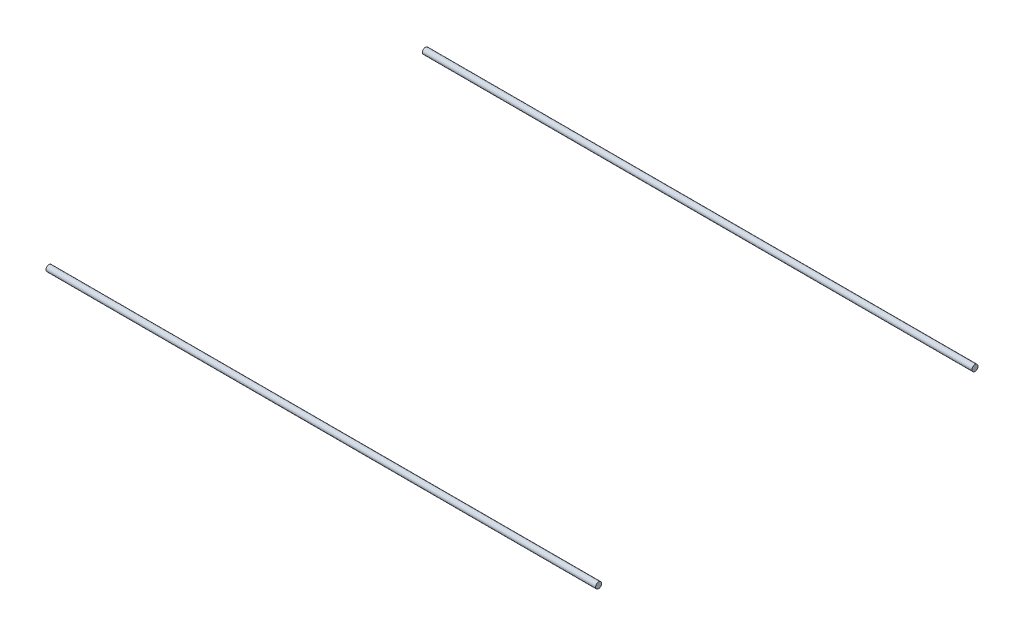
ISO-10303-21;
HEADER;
FILE_DESCRIPTION(('STEP AP214'),'2;1');
FILE_NAME('part.step','',(''),(''),'','','');
FILE_SCHEMA(('AUTOMOTIVE_DESIGN { 1 0 10303 214 1 1 1 1 }'));
ENDSEC;
DATA;
#1=APPLICATION_CONTEXT('core data for automotive mechanical design processes');
#2=APPLICATION_PROTOCOL_DEFINITION('international standard','automotive_design',2000,#1);
#3=PRODUCT_CONTEXT('',#1,'mechanical');
#4=PRODUCT('Part','Part','',(#3));
#5=PRODUCT_RELATED_PRODUCT_CATEGORY('part','',(#4));
#6=PRODUCT_DEFINITION_FORMATION('','',#4);
#7=PRODUCT_DEFINITION_CONTEXT('part definition',#1,'design');
#8=PRODUCT_DEFINITION('design','',#6,#7);
#9=PRODUCT_DEFINITION_SHAPE('','',#8);
#10=(LENGTH_UNIT() NAMED_UNIT(*) SI_UNIT(.MILLI.,.METRE.));
#11=(NAMED_UNIT(*) PLANE_ANGLE_UNIT() SI_UNIT($,.RADIAN.));
#12=(NAMED_UNIT(*) SI_UNIT($,.STERADIAN.) SOLID_ANGLE_UNIT());
#13=UNCERTAINTY_MEASURE_WITH_UNIT(LENGTH_MEASURE(1.E-05),#10,'distance_accuracy_value','');
#14=(GEOMETRIC_REPRESENTATION_CONTEXT(3) GLOBAL_UNCERTAINTY_ASSIGNED_CONTEXT((#13)) GLOBAL_UNIT_ASSIGNED_CONTEXT((#10,
#11,#12)) REPRESENTATION_CONTEXT('',''));
#15=CARTESIAN_POINT('',(0.,0.,0.));
#16=DIRECTION('',(0.,0.,1.));
#17=DIRECTION('',(1.,0.,0.));
#18=AXIS2_PLACEMENT_3D('',#15,#16,#17);
#19=CARTESIAN_POINT('',(365.,30.384042372427,250.));
#20=DIRECTION('',(-1.,0.,0.));
#21=DIRECTION('',(0.,0.,1.));
#22=AXIS2_PLACEMENT_3D('',#19,#20,#21);
#23=CYLINDRICAL_SURFACE('',#22,3.99999999999999);
#24=CARTESIAN_POINT('',(365.,30.384042372427,250.));
#25=DIRECTION('',(-1.,0.,0.));
#26=DIRECTION('',(0.,0.,1.));
#27=AXIS2_PLACEMENT_3D('',#24,#25,#26);
#28=CIRCLE('',#27,3.99999999999999);
#29=CARTESIAN_POINT('',(365.,30.384042372427,254.));
#30=VERTEX_POINT('',#29);
#31=EDGE_CURVE('E52',#30,#30,#28,.T.);
#32=ORIENTED_EDGE('',*,*,#31,.T.);
#33=EDGE_LOOP('',(#32));
#34=FACE_BOUND('',#33,.T.);
#35=CARTESIAN_POINT('',(-365.,30.384042372427,250.));
#36=DIRECTION('',(-1.,0.,0.));
#37=DIRECTION('',(0.,0.,1.));
#38=AXIS2_PLACEMENT_3D('',#35,#36,#37);
#39=CIRCLE('',#38,3.99999999999999);
#40=CARTESIAN_POINT('',(-365.,30.384042372427,254.));
#41=VERTEX_POINT('',#40);
#42=EDGE_CURVE('E11',#41,#41,#39,.T.);
#43=ORIENTED_EDGE('',*,*,#42,.F.);
#44=EDGE_LOOP('',(#43));
#45=FACE_BOUND('',#44,.T.);
#46=ADVANCED_FACE('F48',(#34,#45),#23,.T.);
#47=CARTESIAN_POINT('',(365.,30.384042372427,250.));
#48=DIRECTION('',(-1.,0.,0.));
#49=DIRECTION('',(0.,0.,1.));
#50=AXIS2_PLACEMENT_3D('',#47,#48,#49);
#51=PLANE('',#50);
#52=ORIENTED_EDGE('',*,*,#31,.F.);
#53=EDGE_LOOP('',(#52));
#54=FACE_BOUND('',#53,.T.);
#55=ADVANCED_FACE('F50',(#54),#51,.F.);
#56=CARTESIAN_POINT('',(-365.,30.384042372427,250.));
#57=DIRECTION('',(-1.,0.,0.));
#58=DIRECTION('',(0.,0.,1.));
#59=AXIS2_PLACEMENT_3D('',#56,#57,#58);
#60=PLANE('',#59);
#61=ORIENTED_EDGE('',*,*,#42,.T.);
#62=EDGE_LOOP('',(#61));
#63=FACE_BOUND('',#62,.T.);
#64=ADVANCED_FACE('F64',(#63),#60,.T.);
#65=CLOSED_SHELL('',(#46,#55,#64));
#66=MANIFOLD_SOLID_BREP('B2',#65);
#67=CARTESIAN_POINT('',(365.,30.384042372427,-250.));
#68=DIRECTION('',(-1.,0.,0.));
#69=DIRECTION('',(0.,0.,1.));
#70=AXIS2_PLACEMENT_3D('',#67,#68,#69);
#71=CYLINDRICAL_SURFACE('',#70,3.99999999999999);
#72=CARTESIAN_POINT('',(365.,30.384042372427,-250.));
#73=DIRECTION('',(-1.,0.,0.));
#74=DIRECTION('',(0.,0.,1.));
#75=AXIS2_PLACEMENT_3D('',#72,#73,#74);
#76=CIRCLE('',#75,3.99999999999999);
#77=CARTESIAN_POINT('',(365.,30.384042372427,-246.));
#78=VERTEX_POINT('',#77);
#79=EDGE_CURVE('E47',#78,#78,#76,.F.);
#80=ORIENTED_EDGE('',*,*,#79,.F.);
#81=EDGE_LOOP('',(#80));
#82=FACE_BOUND('',#81,.T.);
#83=CARTESIAN_POINT('',(-365.,30.384042372427,-250.));
#84=DIRECTION('',(-1.,0.,0.));
#85=DIRECTION('',(0.,0.,1.));
#86=AXIS2_PLACEMENT_3D('',#83,#84,#85);
#87=CIRCLE('',#86,3.99999999999999);
#88=CARTESIAN_POINT('',(-365.,30.384042372427,-246.));
#89=VERTEX_POINT('',#88);
#90=EDGE_CURVE('E91',#89,#89,#87,.F.);
#91=ORIENTED_EDGE('',*,*,#90,.T.);
#92=EDGE_LOOP('',(#91));
#93=FACE_BOUND('',#92,.T.);
#94=ADVANCED_FACE('F88',(#82,#93),#71,.T.);
#95=CARTESIAN_POINT('',(365.,0.,0.));
#96=DIRECTION('',(-1.,0.,0.));
#97=DIRECTION('',(0.,0.,1.));
#98=AXIS2_PLACEMENT_3D('',#95,#96,#97);
#99=PLANE('',#98);
#100=ORIENTED_EDGE('',*,*,#79,.T.);
#101=EDGE_LOOP('',(#100));
#102=FACE_BOUND('',#101,.T.);
#103=ADVANCED_FACE('F103',(#102),#99,.F.);
#104=CARTESIAN_POINT('',(-365.,0.,0.));
#105=DIRECTION('',(-1.,0.,0.));
#106=DIRECTION('',(0.,0.,1.));
#107=AXIS2_PLACEMENT_3D('',#104,#105,#106);
#108=PLANE('',#107);
#109=ORIENTED_EDGE('',*,*,#90,.F.);
#110=EDGE_LOOP('',(#109));
#111=FACE_BOUND('',#110,.T.);
#112=ADVANCED_FACE('F101',(#111),#108,.T.);
#113=CLOSED_SHELL('',(#94,#103,#112));
#114=MANIFOLD_SOLID_BREP('B6',#113);
#115=ADVANCED_BREP_SHAPE_REPRESENTATION('',(#18,#66,#114),#14);
#116=SHAPE_DEFINITION_REPRESENTATION(#9,#115);
ENDSEC;
END-ISO-10303-21;
